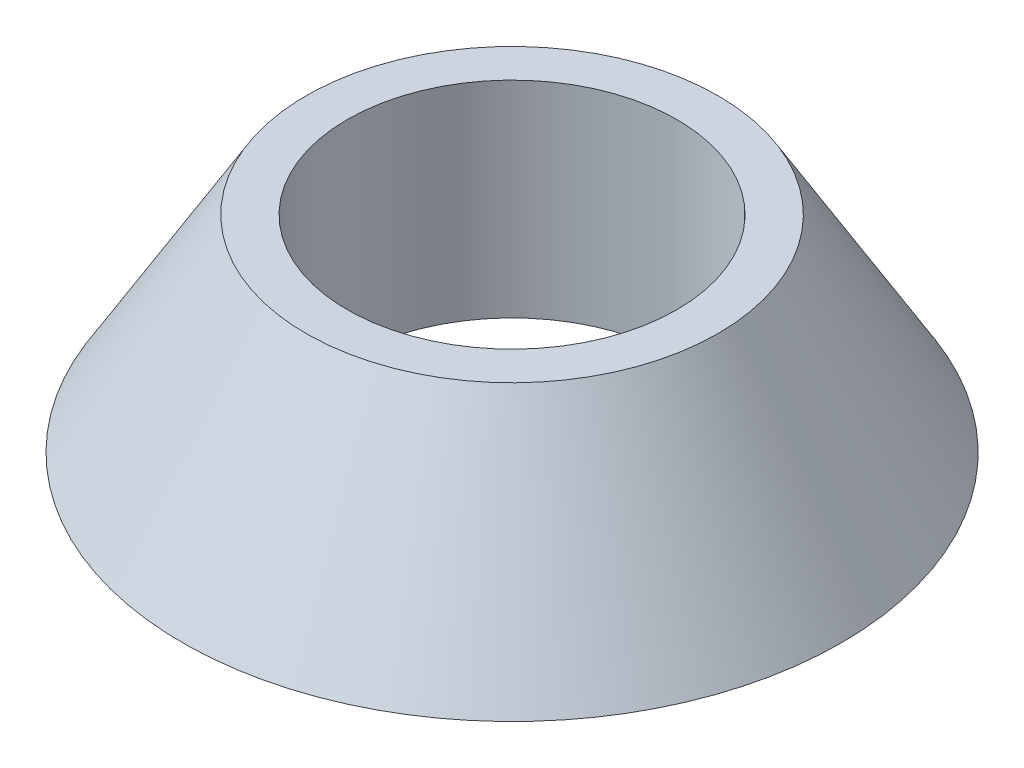
ISO-10303-21;
HEADER;
FILE_DESCRIPTION(('STEP AP214'),'2;1');
FILE_NAME('part.step','',(''),(''),'','','');
FILE_SCHEMA(('AUTOMOTIVE_DESIGN { 1 0 10303 214 1 1 1 1 }'));
ENDSEC;
DATA;
#1=APPLICATION_CONTEXT('core data for automotive mechanical design processes');
#2=APPLICATION_PROTOCOL_DEFINITION('international standard','automotive_design',2000,#1);
#3=PRODUCT_CONTEXT('',#1,'mechanical');
#4=PRODUCT('Part','Part','',(#3));
#5=PRODUCT_RELATED_PRODUCT_CATEGORY('part','',(#4));
#6=PRODUCT_DEFINITION_FORMATION('','',#4);
#7=PRODUCT_DEFINITION_CONTEXT('part definition',#1,'design');
#8=PRODUCT_DEFINITION('design','',#6,#7);
#9=PRODUCT_DEFINITION_SHAPE('','',#8);
#10=(LENGTH_UNIT() NAMED_UNIT(*) SI_UNIT(.MILLI.,.METRE.));
#11=(NAMED_UNIT(*) PLANE_ANGLE_UNIT() SI_UNIT($,.RADIAN.));
#12=(NAMED_UNIT(*) SI_UNIT($,.STERADIAN.) SOLID_ANGLE_UNIT());
#13=UNCERTAINTY_MEASURE_WITH_UNIT(LENGTH_MEASURE(1.E-05),#10,'distance_accuracy_value','');
#14=(GEOMETRIC_REPRESENTATION_CONTEXT(3) GLOBAL_UNCERTAINTY_ASSIGNED_CONTEXT((#13)) GLOBAL_UNIT_ASSIGNED_CONTEXT((#10,
#11,#12)) REPRESENTATION_CONTEXT('',''));
#15=CARTESIAN_POINT('',(0.,0.,0.));
#16=DIRECTION('',(0.,0.,1.));
#17=DIRECTION('',(1.,0.,0.));
#18=AXIS2_PLACEMENT_3D('',#15,#16,#17);
#19=CARTESIAN_POINT('',(8.,0.,0.));
#20=DIRECTION('',(0.,-1.,0.));
#21=DIRECTION('',(1.,0.,0.));
#22=AXIS2_PLACEMENT_3D('',#19,#20,#21);
#23=PLANE('',#22);
#24=CARTESIAN_POINT('',(0.,0.,0.));
#25=DIRECTION('',(0.,-1.,0.));
#26=DIRECTION('',(1.,0.,0.));
#27=AXIS2_PLACEMENT_3D('',#24,#25,#26);
#28=CIRCLE('',#27,8.);
#29=CARTESIAN_POINT('',(8.,0.,0.));
#30=VERTEX_POINT('',#29);
#31=EDGE_CURVE('E44',#30,#30,#28,.T.);
#32=ORIENTED_EDGE('',*,*,#31,.T.);
#33=EDGE_LOOP('',(#32));
#34=FACE_BOUND('',#33,.T.);
#35=CARTESIAN_POINT('',(0.,0.,0.));
#36=DIRECTION('',(0.,-1.,0.));
#37=DIRECTION('',(1.,0.,0.));
#38=AXIS2_PLACEMENT_3D('',#35,#36,#37);
#39=CIRCLE('',#38,4.);
#40=CARTESIAN_POINT('',(4.,0.,0.));
#41=VERTEX_POINT('',#40);
#42=EDGE_CURVE('E10',#41,#41,#39,.T.);
#43=ORIENTED_EDGE('',*,*,#42,.F.);
#44=EDGE_LOOP('',(#43));
#45=FACE_BOUND('',#44,.T.);
#46=ADVANCED_FACE('F30',(#34,#45),#23,.T.);
#47=CARTESIAN_POINT('',(0.,0.,0.));
#48=DIRECTION('',(0.,-1.,0.));
#49=DIRECTION('',(1.,0.,0.));
#50=AXIS2_PLACEMENT_3D('',#47,#48,#49);
#51=CYLINDRICAL_SURFACE('',#50,4.00000000000001);
#52=ORIENTED_EDGE('',*,*,#42,.T.);
#53=EDGE_LOOP('',(#52));
#54=FACE_BOUND('',#53,.T.);
#55=CARTESIAN_POINT('',(0.,4.99999999999999,0.));
#56=DIRECTION('',(0.,-1.,0.));
#57=DIRECTION('',(1.,0.,0.));
#58=AXIS2_PLACEMENT_3D('',#55,#56,#57);
#59=CIRCLE('',#58,4.00000000000002);
#60=CARTESIAN_POINT('',(4.,5.,0.));
#61=VERTEX_POINT('',#60);
#62=EDGE_CURVE('E36',#61,#61,#59,.T.);
#63=ORIENTED_EDGE('',*,*,#62,.F.);
#64=EDGE_LOOP('',(#63));
#65=FACE_BOUND('',#64,.T.);
#66=ADVANCED_FACE('F60',(#54,#65),#51,.F.);
#67=CARTESIAN_POINT('',(4.,5.,0.));
#68=DIRECTION('',(0.,1.,0.));
#69=DIRECTION('',(-1.,0.,0.));
#70=AXIS2_PLACEMENT_3D('',#67,#68,#69);
#71=PLANE('',#70);
#72=ORIENTED_EDGE('',*,*,#62,.T.);
#73=EDGE_LOOP('',(#72));
#74=FACE_BOUND('',#73,.T.);
#75=CARTESIAN_POINT('',(0.,4.99999999999998,0.));
#76=DIRECTION('',(0.,-1.,0.));
#77=DIRECTION('',(1.,0.,0.));
#78=AXIS2_PLACEMENT_3D('',#75,#76,#77);
#79=CIRCLE('',#78,5.00000000000002);
#80=CARTESIAN_POINT('',(5.,5.,0.));
#81=VERTEX_POINT('',#80);
#82=EDGE_CURVE('E40',#81,#81,#79,.T.);
#83=ORIENTED_EDGE('',*,*,#82,.F.);
#84=EDGE_LOOP('',(#83));
#85=FACE_BOUND('',#84,.T.);
#86=ADVANCED_FACE('F54',(#74,#85),#71,.T.);
#87=CARTESIAN_POINT('',(0.,0.,0.));
#88=DIRECTION('',(0.,-1.,0.));
#89=DIRECTION('',(1.,0.,0.));
#90=AXIS2_PLACEMENT_3D('',#87,#88,#89);
#91=CONICAL_SURFACE('',#90,8.,0.540419500270581);
#92=ORIENTED_EDGE('',*,*,#82,.T.);
#93=EDGE_LOOP('',(#92));
#94=FACE_BOUND('',#93,.T.);
#95=ORIENTED_EDGE('',*,*,#31,.F.);
#96=EDGE_LOOP('',(#95));
#97=FACE_BOUND('',#96,.T.);
#98=ADVANCED_FACE('F52',(#94,#97),#91,.T.);
#99=CLOSED_SHELL('',(#46,#66,#86,#98));
#100=MANIFOLD_SOLID_BREP('B2',#99);
#101=ADVANCED_BREP_SHAPE_REPRESENTATION('',(#18,#100),#14);
#102=SHAPE_DEFINITION_REPRESENTATION(#9,#101);
ENDSEC;
END-ISO-10303-21;
